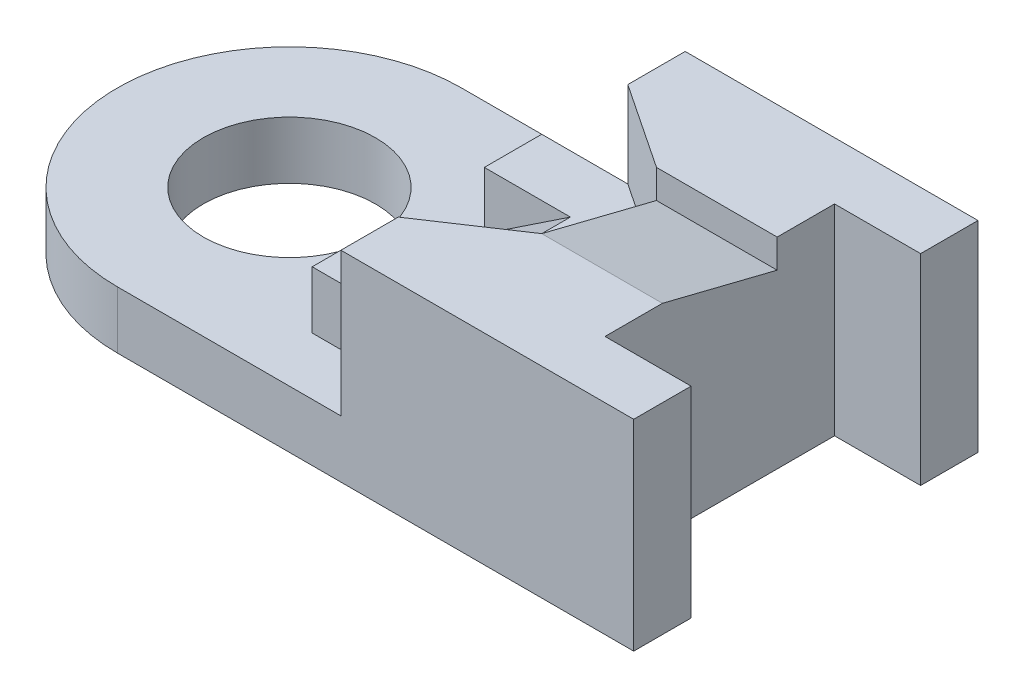
ISO-10303-21;
HEADER;
FILE_DESCRIPTION(('STEP AP214'),'2;1');
FILE_NAME('part.step','',(''),(''),'','','');
FILE_SCHEMA(('AUTOMOTIVE_DESIGN { 1 0 10303 214 1 1 1 1 }'));
ENDSEC;
DATA;
#1=APPLICATION_CONTEXT('core data for automotive mechanical design processes');
#2=APPLICATION_PROTOCOL_DEFINITION('international standard','automotive_design',2000,#1);
#3=PRODUCT_CONTEXT('',#1,'mechanical');
#4=PRODUCT('Part','Part','',(#3));
#5=PRODUCT_RELATED_PRODUCT_CATEGORY('part','',(#4));
#6=PRODUCT_DEFINITION_FORMATION('','',#4);
#7=PRODUCT_DEFINITION_CONTEXT('part definition',#1,'design');
#8=PRODUCT_DEFINITION('design','',#6,#7);
#9=PRODUCT_DEFINITION_SHAPE('','',#8);
#10=(LENGTH_UNIT() NAMED_UNIT(*) SI_UNIT(.MILLI.,.METRE.));
#11=(NAMED_UNIT(*) PLANE_ANGLE_UNIT() SI_UNIT($,.RADIAN.));
#12=(NAMED_UNIT(*) SI_UNIT($,.STERADIAN.) SOLID_ANGLE_UNIT());
#13=UNCERTAINTY_MEASURE_WITH_UNIT(LENGTH_MEASURE(1.E-05),#10,'distance_accuracy_value','');
#14=(GEOMETRIC_REPRESENTATION_CONTEXT(3) GLOBAL_UNCERTAINTY_ASSIGNED_CONTEXT((#13)) GLOBAL_UNIT_ASSIGNED_CONTEXT((#10,
#11,#12)) REPRESENTATION_CONTEXT('',''));
#15=CARTESIAN_POINT('',(0.,0.,0.));
#16=DIRECTION('',(0.,0.,1.));
#17=DIRECTION('',(1.,0.,0.));
#18=AXIS2_PLACEMENT_3D('',#15,#16,#17);
#19=CARTESIAN_POINT('',(0.,7.,0.));
#20=DIRECTION('',(0.,1.,0.));
#21=DIRECTION('',(0.,0.,1.));
#22=AXIS2_PLACEMENT_3D('',#19,#20,#21);
#23=PLANE('',#22);
#24=DIRECTION('',(-1.,0.,0.));
#25=VECTOR('',#24,1.);
#26=CARTESIAN_POINT('',(0.,7.,-2.));
#27=LINE('',#26,#25);
#28=CARTESIAN_POINT('',(6.,7.,-2.));
#29=VERTEX_POINT('',#28);
#30=CARTESIAN_POINT('',(1.79431217059984,7.,-2.));
#31=VERTEX_POINT('',#30);
#32=EDGE_CURVE('E11',#29,#31,#27,.T.);
#33=ORIENTED_EDGE('',*,*,#32,.F.);
#34=DIRECTION('',(0.,0.,-1.));
#35=VECTOR('',#34,1.);
#36=CARTESIAN_POINT('',(6.,7.,4.));
#37=LINE('',#36,#35);
#38=CARTESIAN_POINT('',(6.,7.,-4.));
#39=VERTEX_POINT('',#38);
#40=EDGE_CURVE('E208',#29,#39,#37,.T.);
#41=ORIENTED_EDGE('',*,*,#40,.T.);
#42=DIRECTION('',(1.,0.,0.));
#43=VECTOR('',#42,1.);
#44=CARTESIAN_POINT('',(6.,7.,-4.));
#45=LINE('',#44,#43);
#46=CARTESIAN_POINT('',(9.,7.,-4.));
#47=VERTEX_POINT('',#46);
#48=EDGE_CURVE('E207',#39,#47,#45,.T.);
#49=ORIENTED_EDGE('',*,*,#48,.T.);
#50=DIRECTION('',(0.,0.,-1.));
#51=VECTOR('',#50,1.);
#52=CARTESIAN_POINT('',(9.,7.,-4.));
#53=LINE('',#52,#51);
#54=CARTESIAN_POINT('',(9.,7.,-6.));
#55=VERTEX_POINT('',#54);
#56=EDGE_CURVE('E222',#47,#55,#53,.T.);
#57=ORIENTED_EDGE('',*,*,#56,.T.);
#58=DIRECTION('',(-1.,0.,0.));
#59=VECTOR('',#58,1.);
#60=CARTESIAN_POINT('',(9.,7.,-6.));
#61=LINE('',#60,#59);
#62=CARTESIAN_POINT('',(-1.20568782940016,7.,-6.));
#63=VERTEX_POINT('',#62);
#64=EDGE_CURVE('E383',#55,#63,#61,.T.);
#65=ORIENTED_EDGE('',*,*,#64,.T.);
#66=DIRECTION('',(0.,0.,1.));
#67=VECTOR('',#66,1.);
#68=CARTESIAN_POINT('',(-1.20568782940016,7.,-6.));
#69=LINE('',#68,#67);
#70=CARTESIAN_POINT('',(-1.20568782940016,7.,-4.));
#71=VERTEX_POINT('',#70);
#72=EDGE_CURVE('E381',#63,#71,#69,.T.);
#73=ORIENTED_EDGE('',*,*,#72,.T.);
#74=DIRECTION('',(0.832050294337844,0.,0.554700196225229));
#75=VECTOR('',#74,1.);
#76=CARTESIAN_POINT('',(-1.20568782940016,7.,-4.));
#77=LINE('',#76,#75);
#78=EDGE_CURVE('E378',#71,#31,#77,.T.);
#79=ORIENTED_EDGE('',*,*,#78,.T.);
#80=EDGE_LOOP('',(#33,#41,#49,#57,#65,#73,#79));
#81=FACE_BOUND('',#80,.T.);
#82=ADVANCED_FACE('F33',(#81),#23,.T.);
#83=CARTESIAN_POINT('',(-4.20568782940016,4.,-4.));
#84=DIRECTION('',(1.,0.,0.));
#85=DIRECTION('',(0.,0.,-1.));
#86=AXIS2_PLACEMENT_3D('',#83,#84,#85);
#87=PLANE('',#86);
#88=DIRECTION('',(0.,-1.,0.));
#89=VECTOR('',#88,1.);
#90=CARTESIAN_POINT('',(-4.20568782940015,2.,-2.));
#91=LINE('',#90,#89);
#92=CARTESIAN_POINT('',(-4.20568782940015,4.,-2.));
#93=VERTEX_POINT('',#92);
#94=CARTESIAN_POINT('',(-4.20568782940015,2.,-2.));
#95=VERTEX_POINT('',#94);
#96=EDGE_CURVE('E237',#93,#95,#91,.T.);
#97=ORIENTED_EDGE('',*,*,#96,.F.);
#98=DIRECTION('',(0.,0.,1.));
#99=VECTOR('',#98,1.);
#100=CARTESIAN_POINT('',(-4.20568782940016,4.,-4.));
#101=LINE('',#100,#99);
#102=CARTESIAN_POINT('',(-4.20568782940016,4.,-4.));
#103=VERTEX_POINT('',#102);
#104=EDGE_CURVE('E257',#103,#93,#101,.T.);
#105=ORIENTED_EDGE('',*,*,#104,.F.);
#106=DIRECTION('',(0.,-1.,0.));
#107=VECTOR('',#106,1.);
#108=CARTESIAN_POINT('',(-4.20568782940016,4.,-4.));
#109=LINE('',#108,#107);
#110=CARTESIAN_POINT('',(-4.20568782940016,2.,-4.));
#111=VERTEX_POINT('',#110);
#112=EDGE_CURVE('E285',#103,#111,#109,.T.);
#113=ORIENTED_EDGE('',*,*,#112,.T.);
#114=DIRECTION('',(0.,0.,1.));
#115=VECTOR('',#114,1.);
#116=CARTESIAN_POINT('',(-4.20568782940016,2.,-4.));
#117=LINE('',#116,#115);
#118=EDGE_CURVE('E269',#111,#95,#117,.T.);
#119=ORIENTED_EDGE('',*,*,#118,.T.);
#120=EDGE_LOOP('',(#97,#105,#113,#119));
#121=FACE_BOUND('',#120,.T.);
#122=ADVANCED_FACE('F441',(#121),#87,.F.);
#123=CARTESIAN_POINT('',(0.,4.,0.));
#124=DIRECTION('',(0.,1.,0.));
#125=DIRECTION('',(0.,0.,1.));
#126=AXIS2_PLACEMENT_3D('',#123,#124,#125);
#127=PLANE('',#126);
#128=DIRECTION('',(-0.832050294337844,0.,0.554700196225229));
#129=VECTOR('',#128,1.);
#130=CARTESIAN_POINT('',(1.79431217059984,4.,2.));
#131=LINE('',#130,#129);
#132=CARTESIAN_POINT('',(1.79431217059984,4.,2.));
#133=VERTEX_POINT('',#132);
#134=CARTESIAN_POINT('',(-1.20568782940016,4.,4.));
#135=VERTEX_POINT('',#134);
#136=EDGE_CURVE('E48',#133,#135,#131,.T.);
#137=ORIENTED_EDGE('',*,*,#136,.F.);
#138=DIRECTION('',(0.,0.,1.));
#139=VECTOR('',#138,1.);
#140=CARTESIAN_POINT('',(1.79431217059984,4.,-2.));
#141=LINE('',#140,#139);
#142=CARTESIAN_POINT('',(1.79431217059984,4.,-2.));
#143=VERTEX_POINT('',#142);
#144=EDGE_CURVE('E219',#143,#133,#141,.T.);
#145=ORIENTED_EDGE('',*,*,#144,.F.);
#146=DIRECTION('',(0.832050294337844,0.,0.554700196225229));
#147=VECTOR('',#146,1.);
#148=CARTESIAN_POINT('',(-1.20568782940016,4.,-4.));
#149=LINE('',#148,#147);
#150=CARTESIAN_POINT('',(-1.20568782940016,4.,-4.));
#151=VERTEX_POINT('',#150);
#152=EDGE_CURVE('E216',#151,#143,#149,.T.);
#153=ORIENTED_EDGE('',*,*,#152,.F.);
#154=DIRECTION('',(-1.,0.,0.));
#155=VECTOR('',#154,1.);
#156=CARTESIAN_POINT('',(-1.20568782940016,4.,-4.));
#157=LINE('',#156,#155);
#158=EDGE_CURVE('E253',#151,#103,#157,.T.);
#159=ORIENTED_EDGE('',*,*,#158,.T.);
#160=ORIENTED_EDGE('',*,*,#104,.T.);
#161=DIRECTION('',(-1.,0.,0.));
#162=VECTOR('',#161,1.);
#163=CARTESIAN_POINT('',(-4.20568782940015,4.,-2.));
#164=LINE('',#163,#162);
#165=CARTESIAN_POINT('',(-1.20568782940016,4.,-2.));
#166=VERTEX_POINT('',#165);
#167=EDGE_CURVE('E235',#166,#93,#164,.T.);
#168=ORIENTED_EDGE('',*,*,#167,.F.);
#169=DIRECTION('',(0.,0.,1.));
#170=VECTOR('',#169,1.);
#171=CARTESIAN_POINT('',(-1.20568782940016,4.,-2.));
#172=LINE('',#171,#170);
#173=CARTESIAN_POINT('',(-1.20568782940016,4.,2.));
#174=VERTEX_POINT('',#173);
#175=EDGE_CURVE('E248',#166,#174,#172,.T.);
#176=ORIENTED_EDGE('',*,*,#175,.T.);
#177=DIRECTION('',(-1.,0.,0.));
#178=VECTOR('',#177,1.);
#179=CARTESIAN_POINT('',(-4.20568782940015,4.,2.));
#180=LINE('',#179,#178);
#181=CARTESIAN_POINT('',(-4.20568782940015,4.,2.));
#182=VERTEX_POINT('',#181);
#183=EDGE_CURVE('E234',#174,#182,#180,.T.);
#184=ORIENTED_EDGE('',*,*,#183,.T.);
#185=CARTESIAN_POINT('',(-4.20568782940015,4.,4.));
#186=VERTEX_POINT('',#185);
#187=EDGE_CURVE('E255',#182,#186,#101,.T.);
#188=ORIENTED_EDGE('',*,*,#187,.T.);
#189=DIRECTION('',(1.,0.,0.));
#190=VECTOR('',#189,1.);
#191=CARTESIAN_POINT('',(-4.20568782940015,4.,4.));
#192=LINE('',#191,#190);
#193=EDGE_CURVE('E260',#186,#135,#192,.T.);
#194=ORIENTED_EDGE('',*,*,#193,.T.);
#195=EDGE_LOOP('',(#137,#145,#153,#159,#160,#168,#176,#184,#188,#194));
#196=FACE_BOUND('',#195,.T.);
#197=ADVANCED_FACE('F446',(#196),#127,.T.);
#198=CARTESIAN_POINT('',(-9.,2.,0.));
#199=DIRECTION('',(0.,1.,0.));
#200=DIRECTION('',(0.,0.,1.));
#201=AXIS2_PLACEMENT_3D('',#198,#199,#200);
#202=PLANE('',#201);
#203=DIRECTION('',(0.,0.,1.));
#204=VECTOR('',#203,1.);
#205=CARTESIAN_POINT('',(-1.20568782940016,2.,4.));
#206=LINE('',#205,#204);
#207=CARTESIAN_POINT('',(-1.20568782940016,2.,4.));
#208=VERTEX_POINT('',#207);
#209=CARTESIAN_POINT('',(-1.20568782940016,2.,6.));
#210=VERTEX_POINT('',#209);
#211=EDGE_CURVE('E256',#208,#210,#206,.T.);
#212=ORIENTED_EDGE('',*,*,#211,.F.);
#213=DIRECTION('',(1.,0.,0.));
#214=VECTOR('',#213,1.);
#215=CARTESIAN_POINT('',(-4.20568782940015,2.,4.));
#216=LINE('',#215,#214);
#217=CARTESIAN_POINT('',(-4.20568782940015,2.,4.));
#218=VERTEX_POINT('',#217);
#219=EDGE_CURVE('E272',#218,#208,#216,.T.);
#220=ORIENTED_EDGE('',*,*,#219,.F.);
#221=CARTESIAN_POINT('',(-4.20568782940015,2.,2.));
#222=VERTEX_POINT('',#221);
#223=EDGE_CURVE('E268',#222,#218,#117,.T.);
#224=ORIENTED_EDGE('',*,*,#223,.F.);
#225=DIRECTION('',(0.,0.,1.));
#226=VECTOR('',#225,1.);
#227=CARTESIAN_POINT('',(-4.20568782940015,2.,-2.));
#228=LINE('',#227,#226);
#229=EDGE_CURVE('E243',#95,#222,#228,.T.);
#230=ORIENTED_EDGE('',*,*,#229,.F.);
#231=ORIENTED_EDGE('',*,*,#118,.F.);
#232=DIRECTION('',(-1.,0.,0.));
#233=VECTOR('',#232,1.);
#234=CARTESIAN_POINT('',(-1.20568782940016,2.,-4.));
#235=LINE('',#234,#233);
#236=CARTESIAN_POINT('',(-1.20568782940016,2.,-4.));
#237=VERTEX_POINT('',#236);
#238=EDGE_CURVE('E265',#237,#111,#235,.T.);
#239=ORIENTED_EDGE('',*,*,#238,.F.);
#240=DIRECTION('',(0.,0.,1.));
#241=VECTOR('',#240,1.);
#242=CARTESIAN_POINT('',(-1.20568782940016,2.,-6.));
#243=LINE('',#242,#241);
#244=CARTESIAN_POINT('',(-1.20568782940016,2.,-6.));
#245=VERTEX_POINT('',#244);
#246=EDGE_CURVE('E251',#245,#237,#243,.T.);
#247=ORIENTED_EDGE('',*,*,#246,.F.);
#248=DIRECTION('',(-1.,0.,0.));
#249=VECTOR('',#248,1.);
#250=CARTESIAN_POINT('',(-9.,2.,-6.));
#251=LINE('',#250,#249);
#252=CARTESIAN_POINT('',(-9.,2.,-6.));
#253=VERTEX_POINT('',#252);
#254=EDGE_CURVE('E301',#245,#253,#251,.T.);
#255=ORIENTED_EDGE('',*,*,#254,.T.);
#256=CARTESIAN_POINT('',(-9.,2.,0.));
#257=DIRECTION('',(0.,1.,0.));
#258=DIRECTION('',(0.,0.,1.));
#259=AXIS2_PLACEMENT_3D('',#256,#257,#258);
#260=CIRCLE('',#259,6.);
#261=CARTESIAN_POINT('',(-9.,2.,6.));
#262=VERTEX_POINT('',#261);
#263=EDGE_CURVE('E303',#253,#262,#260,.T.);
#264=ORIENTED_EDGE('',*,*,#263,.T.);
#265=DIRECTION('',(1.,0.,0.));
#266=VECTOR('',#265,1.);
#267=CARTESIAN_POINT('',(-9.,2.,6.));
#268=LINE('',#267,#266);
#269=EDGE_CURVE('E306',#262,#210,#268,.T.);
#270=ORIENTED_EDGE('',*,*,#269,.T.);
#271=EDGE_LOOP('',(#212,#220,#224,#230,#231,#239,#247,#255,#264,#270));
#272=FACE_BOUND('',#271,.T.);
#273=CARTESIAN_POINT('',(-9.,2.,0.));
#274=DIRECTION('',(0.,1.,0.));
#275=DIRECTION('',(0.,0.,1.));
#276=AXIS2_PLACEMENT_3D('',#273,#274,#275);
#277=CIRCLE('',#276,3.);
#278=CARTESIAN_POINT('',(-9.,2.,3.));
#279=VERTEX_POINT('',#278);
#280=EDGE_CURVE('E295',#279,#279,#277,.T.);
#281=ORIENTED_EDGE('',*,*,#280,.F.);
#282=EDGE_LOOP('',(#281));
#283=FACE_BOUND('',#282,.T.);
#284=ADVANCED_FACE('F426',(#272,#283),#202,.T.);
#285=CARTESIAN_POINT('',(-9.,0.,0.));
#286=DIRECTION('',(0.,1.,0.));
#287=DIRECTION('',(0.,0.,1.));
#288=AXIS2_PLACEMENT_3D('',#285,#286,#287);
#289=PLANE('',#288);
#290=DIRECTION('',(-1.,0.,0.));
#291=VECTOR('',#290,1.);
#292=CARTESIAN_POINT('',(-9.,0.,-6.));
#293=LINE('',#292,#291);
#294=CARTESIAN_POINT('',(9.,0.,-6.));
#295=VERTEX_POINT('',#294);
#296=CARTESIAN_POINT('',(-9.,0.,-6.));
#297=VERTEX_POINT('',#296);
#298=EDGE_CURVE('E298',#295,#297,#293,.T.);
#299=ORIENTED_EDGE('',*,*,#298,.F.);
#300=DIRECTION('',(0.,0.,-1.));
#301=VECTOR('',#300,1.);
#302=CARTESIAN_POINT('',(9.,0.,-4.));
#303=LINE('',#302,#301);
#304=CARTESIAN_POINT('',(9.,0.,-4.));
#305=VERTEX_POINT('',#304);
#306=EDGE_CURVE('E304',#305,#295,#303,.T.);
#307=ORIENTED_EDGE('',*,*,#306,.F.);
#308=DIRECTION('',(1.,0.,0.));
#309=VECTOR('',#308,1.);
#310=CARTESIAN_POINT('',(9.,0.,-4.));
#311=LINE('',#310,#309);
#312=CARTESIAN_POINT('',(6.,0.,-4.));
#313=VERTEX_POINT('',#312);
#314=EDGE_CURVE('E321',#313,#305,#311,.T.);
#315=ORIENTED_EDGE('',*,*,#314,.F.);
#316=DIRECTION('',(0.,0.,-1.));
#317=VECTOR('',#316,1.);
#318=CARTESIAN_POINT('',(6.,0.,-4.));
#319=LINE('',#318,#317);
#320=CARTESIAN_POINT('',(6.,0.,4.));
#321=VERTEX_POINT('',#320);
#322=EDGE_CURVE('E319',#321,#313,#319,.T.);
#323=ORIENTED_EDGE('',*,*,#322,.F.);
#324=DIRECTION('',(-1.,0.,0.));
#325=VECTOR('',#324,1.);
#326=CARTESIAN_POINT('',(9.,0.,4.));
#327=LINE('',#326,#325);
#328=CARTESIAN_POINT('',(9.,0.,4.));
#329=VERTEX_POINT('',#328);
#330=EDGE_CURVE('E317',#329,#321,#327,.T.);
#331=ORIENTED_EDGE('',*,*,#330,.F.);
#332=DIRECTION('',(0.,0.,-1.));
#333=VECTOR('',#332,1.);
#334=CARTESIAN_POINT('',(9.,0.,6.));
#335=LINE('',#334,#333);
#336=CARTESIAN_POINT('',(9.,0.,6.));
#337=VERTEX_POINT('',#336);
#338=EDGE_CURVE('E315',#337,#329,#335,.T.);
#339=ORIENTED_EDGE('',*,*,#338,.F.);
#340=DIRECTION('',(1.,0.,0.));
#341=VECTOR('',#340,1.);
#342=CARTESIAN_POINT('',(-9.,0.,6.));
#343=LINE('',#342,#341);
#344=CARTESIAN_POINT('',(-9.,0.,6.));
#345=VERTEX_POINT('',#344);
#346=EDGE_CURVE('E313',#345,#337,#343,.T.);
#347=ORIENTED_EDGE('',*,*,#346,.F.);
#348=CARTESIAN_POINT('',(-9.,0.,0.));
#349=DIRECTION('',(0.,1.,0.));
#350=DIRECTION('',(0.,0.,1.));
#351=AXIS2_PLACEMENT_3D('',#348,#349,#350);
#352=CIRCLE('',#351,6.);
#353=EDGE_CURVE('E311',#297,#345,#352,.T.);
#354=ORIENTED_EDGE('',*,*,#353,.F.);
#355=EDGE_LOOP('',(#299,#307,#315,#323,#331,#339,#347,#354));
#356=FACE_BOUND('',#355,.T.);
#357=CARTESIAN_POINT('',(-9.,0.,0.));
#358=DIRECTION('',(0.,1.,0.));
#359=DIRECTION('',(0.,0.,1.));
#360=AXIS2_PLACEMENT_3D('',#357,#358,#359);
#361=CIRCLE('',#360,3.);
#362=CARTESIAN_POINT('',(-9.,0.,3.));
#363=VERTEX_POINT('',#362);
#364=EDGE_CURVE('E294',#363,#363,#361,.T.);
#365=ORIENTED_EDGE('',*,*,#364,.T.);
#366=EDGE_LOOP('',(#365));
#367=FACE_BOUND('',#366,.T.);
#368=ADVANCED_FACE('F355',(#356,#367),#289,.F.);
#369=CARTESIAN_POINT('',(-9.,2.,-6.));
#370=DIRECTION('',(0.,0.,1.));
#371=DIRECTION('',(1.,0.,0.));
#372=AXIS2_PLACEMENT_3D('',#369,#370,#371);
#373=PLANE('',#372);
#374=ORIENTED_EDGE('',*,*,#298,.T.);
#375=DIRECTION('',(0.,-1.,0.));
#376=VECTOR('',#375,1.);
#377=CARTESIAN_POINT('',(-9.,2.,-6.));
#378=LINE('',#377,#376);
#379=EDGE_CURVE('E193',#253,#297,#378,.T.);
#380=ORIENTED_EDGE('',*,*,#379,.F.);
#381=ORIENTED_EDGE('',*,*,#254,.F.);
#382=DIRECTION('',(0.,-1.,0.));
#383=VECTOR('',#382,1.);
#384=CARTESIAN_POINT('',(-1.20568782940016,4.,-6.));
#385=LINE('',#384,#383);
#386=EDGE_CURVE('E291',#63,#245,#385,.T.);
#387=ORIENTED_EDGE('',*,*,#386,.F.);
#388=ORIENTED_EDGE('',*,*,#64,.F.);
#389=DIRECTION('',(0.,-1.,0.));
#390=VECTOR('',#389,1.);
#391=CARTESIAN_POINT('',(9.,2.,-6.));
#392=LINE('',#391,#390);
#393=EDGE_CURVE('E308',#55,#295,#392,.T.);
#394=ORIENTED_EDGE('',*,*,#393,.T.);
#395=EDGE_LOOP('',(#374,#380,#381,#387,#388,#394));
#396=FACE_BOUND('',#395,.T.);
#397=ADVANCED_FACE('F35',(#396),#373,.F.);
#398=CARTESIAN_POINT('',(-9.,2.,0.));
#399=DIRECTION('',(0.,-1.,0.));
#400=DIRECTION('',(0.,0.,-1.));
#401=AXIS2_PLACEMENT_3D('',#398,#399,#400);
#402=CYLINDRICAL_SURFACE('',#401,6.);
#403=ORIENTED_EDGE('',*,*,#353,.T.);
#404=DIRECTION('',(0.,-1.,0.));
#405=VECTOR('',#404,1.);
#406=CARTESIAN_POINT('',(-9.,2.,6.));
#407=LINE('',#406,#405);
#408=EDGE_CURVE('E340',#262,#345,#407,.T.);
#409=ORIENTED_EDGE('',*,*,#408,.F.);
#410=ORIENTED_EDGE('',*,*,#263,.F.);
#411=ORIENTED_EDGE('',*,*,#379,.T.);
#412=EDGE_LOOP('',(#403,#409,#410,#411));
#413=FACE_BOUND('',#412,.T.);
#414=ADVANCED_FACE('F347',(#413),#402,.T.);
#415=CARTESIAN_POINT('',(-9.,2.,6.));
#416=DIRECTION('',(0.,0.,-1.));
#417=DIRECTION('',(-1.,0.,0.));
#418=AXIS2_PLACEMENT_3D('',#415,#416,#417);
#419=PLANE('',#418);
#420=ORIENTED_EDGE('',*,*,#346,.T.);
#421=DIRECTION('',(0.,-1.,0.));
#422=VECTOR('',#421,1.);
#423=CARTESIAN_POINT('',(9.,2.,6.));
#424=LINE('',#423,#422);
#425=CARTESIAN_POINT('',(9.,7.,6.));
#426=VERTEX_POINT('',#425);
#427=EDGE_CURVE('E337',#426,#337,#424,.T.);
#428=ORIENTED_EDGE('',*,*,#427,.F.);
#429=DIRECTION('',(1.,0.,0.));
#430=VECTOR('',#429,1.);
#431=CARTESIAN_POINT('',(-1.20568782940016,7.,6.));
#432=LINE('',#431,#430);
#433=CARTESIAN_POINT('',(-1.20568782940016,7.,6.));
#434=VERTEX_POINT('',#433);
#435=EDGE_CURVE('E370',#434,#426,#432,.T.);
#436=ORIENTED_EDGE('',*,*,#435,.F.);
#437=DIRECTION('',(0.,-1.,0.));
#438=VECTOR('',#437,1.);
#439=CARTESIAN_POINT('',(-1.20568782940016,4.,6.));
#440=LINE('',#439,#438);
#441=EDGE_CURVE('E262',#434,#210,#440,.T.);
#442=ORIENTED_EDGE('',*,*,#441,.T.);
#443=ORIENTED_EDGE('',*,*,#269,.F.);
#444=ORIENTED_EDGE('',*,*,#408,.T.);
#445=EDGE_LOOP('',(#420,#428,#436,#442,#443,#444));
#446=FACE_BOUND('',#445,.T.);
#447=ADVANCED_FACE('F362',(#446),#419,.F.);
#448=CARTESIAN_POINT('',(9.,2.,6.));
#449=DIRECTION('',(-1.,0.,0.));
#450=DIRECTION('',(0.,0.,1.));
#451=AXIS2_PLACEMENT_3D('',#448,#449,#450);
#452=PLANE('',#451);
#453=ORIENTED_EDGE('',*,*,#338,.T.);
#454=DIRECTION('',(0.,-1.,0.));
#455=VECTOR('',#454,1.);
#456=CARTESIAN_POINT('',(9.,2.,4.));
#457=LINE('',#456,#455);
#458=CARTESIAN_POINT('',(9.,7.,4.));
#459=VERTEX_POINT('',#458);
#460=EDGE_CURVE('E334',#459,#329,#457,.T.);
#461=ORIENTED_EDGE('',*,*,#460,.F.);
#462=DIRECTION('',(0.,0.,-1.));
#463=VECTOR('',#462,1.);
#464=CARTESIAN_POINT('',(9.,7.,6.));
#465=LINE('',#464,#463);
#466=EDGE_CURVE('E369',#426,#459,#465,.T.);
#467=ORIENTED_EDGE('',*,*,#466,.F.);
#468=ORIENTED_EDGE('',*,*,#427,.T.);
#469=EDGE_LOOP('',(#453,#461,#467,#468));
#470=FACE_BOUND('',#469,.T.);
#471=ADVANCED_FACE('F368',(#470),#452,.F.);
#472=CARTESIAN_POINT('',(9.,2.,4.));
#473=DIRECTION('',(0.,0.,1.));
#474=DIRECTION('',(1.,0.,0.));
#475=AXIS2_PLACEMENT_3D('',#472,#473,#474);
#476=PLANE('',#475);
#477=ORIENTED_EDGE('',*,*,#330,.T.);
#478=DIRECTION('',(0.,-1.,0.));
#479=VECTOR('',#478,1.);
#480=CARTESIAN_POINT('',(6.,2.,4.));
#481=LINE('',#480,#479);
#482=CARTESIAN_POINT('',(6.,7.,4.));
#483=VERTEX_POINT('',#482);
#484=EDGE_CURVE('E332',#483,#321,#481,.T.);
#485=ORIENTED_EDGE('',*,*,#484,.F.);
#486=DIRECTION('',(-1.,0.,0.));
#487=VECTOR('',#486,1.);
#488=CARTESIAN_POINT('',(9.,7.,4.));
#489=LINE('',#488,#487);
#490=EDGE_CURVE('E206',#459,#483,#489,.T.);
#491=ORIENTED_EDGE('',*,*,#490,.F.);
#492=ORIENTED_EDGE('',*,*,#460,.T.);
#493=EDGE_LOOP('',(#477,#485,#491,#492));
#494=FACE_BOUND('',#493,.T.);
#495=ADVANCED_FACE('F494',(#494),#476,.F.);
#496=CARTESIAN_POINT('',(6.,2.,-4.));
#497=DIRECTION('',(-1.,0.,0.));
#498=DIRECTION('',(0.,0.,1.));
#499=AXIS2_PLACEMENT_3D('',#496,#497,#498);
#500=PLANE('',#499);
#501=ORIENTED_EDGE('',*,*,#40,.F.);
#502=DIRECTION('',(0.,1.,0.));
#503=VECTOR('',#502,1.);
#504=CARTESIAN_POINT('',(6.,7.,-2.));
#505=LINE('',#504,#503);
#506=CARTESIAN_POINT('',(6.,6.,-2.));
#507=VERTEX_POINT('',#506);
#508=EDGE_CURVE('E200',#507,#29,#505,.T.);
#509=ORIENTED_EDGE('',*,*,#508,.F.);
#510=DIRECTION('',(0.,-0.242535625036333,-0.970142500145332));
#511=VECTOR('',#510,1.);
#512=CARTESIAN_POINT('',(6.,6.,-2.));
#513=LINE('',#512,#511);
#514=CARTESIAN_POINT('',(6.,7.,2.));
#515=VERTEX_POINT('',#514);
#516=EDGE_CURVE('E186',#515,#507,#513,.T.);
#517=ORIENTED_EDGE('',*,*,#516,.F.);
#518=EDGE_CURVE('E199',#483,#515,#37,.T.);
#519=ORIENTED_EDGE('',*,*,#518,.F.);
#520=ORIENTED_EDGE('',*,*,#484,.T.);
#521=ORIENTED_EDGE('',*,*,#322,.T.);
#522=DIRECTION('',(0.,-1.,0.));
#523=VECTOR('',#522,1.);
#524=CARTESIAN_POINT('',(6.,2.,-4.));
#525=LINE('',#524,#523);
#526=EDGE_CURVE('E329',#39,#313,#525,.T.);
#527=ORIENTED_EDGE('',*,*,#526,.F.);
#528=EDGE_LOOP('',(#501,#509,#517,#519,#520,#521,#527));
#529=FACE_BOUND('',#528,.T.);
#530=ADVANCED_FACE('F197',(#529),#500,.F.);
#531=CARTESIAN_POINT('',(9.,2.,-4.));
#532=DIRECTION('',(0.,0.,-1.));
#533=DIRECTION('',(-1.,0.,0.));
#534=AXIS2_PLACEMENT_3D('',#531,#532,#533);
#535=PLANE('',#534);
#536=ORIENTED_EDGE('',*,*,#314,.T.);
#537=DIRECTION('',(0.,-1.,0.));
#538=VECTOR('',#537,1.);
#539=CARTESIAN_POINT('',(9.,2.,-4.));
#540=LINE('',#539,#538);
#541=EDGE_CURVE('E326',#47,#305,#540,.T.);
#542=ORIENTED_EDGE('',*,*,#541,.F.);
#543=ORIENTED_EDGE('',*,*,#48,.F.);
#544=ORIENTED_EDGE('',*,*,#526,.T.);
#545=EDGE_LOOP('',(#536,#542,#543,#544));
#546=FACE_BOUND('',#545,.T.);
#547=ADVANCED_FACE('F401',(#546),#535,.F.);
#548=CARTESIAN_POINT('',(9.,2.,-4.));
#549=DIRECTION('',(-1.,0.,0.));
#550=DIRECTION('',(0.,0.,1.));
#551=AXIS2_PLACEMENT_3D('',#548,#549,#550);
#552=PLANE('',#551);
#553=ORIENTED_EDGE('',*,*,#306,.T.);
#554=ORIENTED_EDGE('',*,*,#393,.F.);
#555=ORIENTED_EDGE('',*,*,#56,.F.);
#556=ORIENTED_EDGE('',*,*,#541,.T.);
#557=EDGE_LOOP('',(#553,#554,#555,#556));
#558=FACE_BOUND('',#557,.T.);
#559=ADVANCED_FACE('F404',(#558),#552,.F.);
#560=CARTESIAN_POINT('',(-9.,2.,0.));
#561=DIRECTION('',(0.,-1.,0.));
#562=DIRECTION('',(0.,0.,-1.));
#563=AXIS2_PLACEMENT_3D('',#560,#561,#562);
#564=CYLINDRICAL_SURFACE('',#563,3.);
#565=ORIENTED_EDGE('',*,*,#280,.T.);
#566=EDGE_LOOP('',(#565));
#567=FACE_BOUND('',#566,.T.);
#568=ORIENTED_EDGE('',*,*,#364,.F.);
#569=EDGE_LOOP('',(#568));
#570=FACE_BOUND('',#569,.T.);
#571=ADVANCED_FACE('F543',(#567,#570),#564,.F.);
#572=CARTESIAN_POINT('',(-1.20568782940016,4.,-6.));
#573=DIRECTION('',(1.,0.,0.));
#574=DIRECTION('',(0.,0.,-1.));
#575=AXIS2_PLACEMENT_3D('',#572,#573,#574);
#576=PLANE('',#575);
#577=ORIENTED_EDGE('',*,*,#246,.T.);
#578=DIRECTION('',(0.,-1.,0.));
#579=VECTOR('',#578,1.);
#580=CARTESIAN_POINT('',(-1.20568782940016,4.,-4.));
#581=LINE('',#580,#579);
#582=EDGE_CURVE('E288',#151,#237,#581,.T.);
#583=ORIENTED_EDGE('',*,*,#582,.F.);
#584=DIRECTION('',(0.,-1.,0.));
#585=VECTOR('',#584,1.);
#586=CARTESIAN_POINT('',(-1.20568782940016,7.,-4.));
#587=LINE('',#586,#585);
#588=EDGE_CURVE('E231',#71,#151,#587,.T.);
#589=ORIENTED_EDGE('',*,*,#588,.F.);
#590=ORIENTED_EDGE('',*,*,#72,.F.);
#591=ORIENTED_EDGE('',*,*,#386,.T.);
#592=EDGE_LOOP('',(#577,#583,#589,#590,#591));
#593=FACE_BOUND('',#592,.T.);
#594=ADVANCED_FACE('F408',(#593),#576,.F.);
#595=CARTESIAN_POINT('',(-1.20568782940016,4.,-4.));
#596=DIRECTION('',(0.,0.,1.));
#597=DIRECTION('',(1.,0.,0.));
#598=AXIS2_PLACEMENT_3D('',#595,#596,#597);
#599=PLANE('',#598);
#600=ORIENTED_EDGE('',*,*,#238,.T.);
#601=ORIENTED_EDGE('',*,*,#112,.F.);
#602=ORIENTED_EDGE('',*,*,#158,.F.);
#603=ORIENTED_EDGE('',*,*,#582,.T.);
#604=EDGE_LOOP('',(#600,#601,#602,#603));
#605=FACE_BOUND('',#604,.T.);
#606=ADVANCED_FACE('F445',(#605),#599,.F.);
#607=ORIENTED_EDGE('',*,*,#187,.F.);
#608=DIRECTION('',(0.,-1.,0.));
#609=VECTOR('',#608,1.);
#610=CARTESIAN_POINT('',(-4.20568782940015,2.,2.));
#611=LINE('',#610,#609);
#612=EDGE_CURVE('E56',#182,#222,#611,.T.);
#613=ORIENTED_EDGE('',*,*,#612,.T.);
#614=ORIENTED_EDGE('',*,*,#223,.T.);
#615=DIRECTION('',(0.,-1.,0.));
#616=VECTOR('',#615,1.);
#617=CARTESIAN_POINT('',(-4.20568782940015,4.,4.));
#618=LINE('',#617,#616);
#619=EDGE_CURVE('E282',#186,#218,#618,.T.);
#620=ORIENTED_EDGE('',*,*,#619,.F.);
#621=EDGE_LOOP('',(#607,#613,#614,#620));
#622=FACE_BOUND('',#621,.T.);
#623=ADVANCED_FACE('F435',(#622),#87,.F.);
#624=CARTESIAN_POINT('',(-4.20568782940015,4.,4.));
#625=DIRECTION('',(0.,0.,-1.));
#626=DIRECTION('',(-1.,0.,0.));
#627=AXIS2_PLACEMENT_3D('',#624,#625,#626);
#628=PLANE('',#627);
#629=ORIENTED_EDGE('',*,*,#219,.T.);
#630=DIRECTION('',(0.,-1.,0.));
#631=VECTOR('',#630,1.);
#632=CARTESIAN_POINT('',(-1.20568782940016,4.,4.));
#633=LINE('',#632,#631);
#634=EDGE_CURVE('E279',#135,#208,#633,.T.);
#635=ORIENTED_EDGE('',*,*,#634,.F.);
#636=ORIENTED_EDGE('',*,*,#193,.F.);
#637=ORIENTED_EDGE('',*,*,#619,.T.);
#638=EDGE_LOOP('',(#629,#635,#636,#637));
#639=FACE_BOUND('',#638,.T.);
#640=ADVANCED_FACE('F430',(#639),#628,.F.);
#641=CARTESIAN_POINT('',(-1.20568782940016,4.,4.));
#642=DIRECTION('',(1.,0.,0.));
#643=DIRECTION('',(0.,0.,-1.));
#644=AXIS2_PLACEMENT_3D('',#641,#642,#643);
#645=PLANE('',#644);
#646=ORIENTED_EDGE('',*,*,#211,.T.);
#647=ORIENTED_EDGE('',*,*,#441,.F.);
#648=DIRECTION('',(0.,0.,1.));
#649=VECTOR('',#648,1.);
#650=CARTESIAN_POINT('',(-1.20568782940016,7.,4.));
#651=LINE('',#650,#649);
#652=CARTESIAN_POINT('',(-1.20568782940016,7.,4.));
#653=VERTEX_POINT('',#652);
#654=EDGE_CURVE('E371',#653,#434,#651,.T.);
#655=ORIENTED_EDGE('',*,*,#654,.F.);
#656=DIRECTION('',(0.,-1.,0.));
#657=VECTOR('',#656,1.);
#658=CARTESIAN_POINT('',(-1.20568782940016,7.,4.));
#659=LINE('',#658,#657);
#660=EDGE_CURVE('E211',#653,#135,#659,.T.);
#661=ORIENTED_EDGE('',*,*,#660,.T.);
#662=ORIENTED_EDGE('',*,*,#634,.T.);
#663=EDGE_LOOP('',(#646,#647,#655,#661,#662));
#664=FACE_BOUND('',#663,.T.);
#665=ADVANCED_FACE('F422',(#664),#645,.F.);
#666=CARTESIAN_POINT('',(-1.20568782940016,4.,-2.));
#667=DIRECTION('',(0.554700196225229,-0.832050294337843,0.));
#668=DIRECTION('',(0.832050294337843,0.554700196225229,0.));
#669=AXIS2_PLACEMENT_3D('',#666,#667,#668);
#670=PLANE('',#669);
#671=DIRECTION('',(0.832050294337843,0.554700196225229,0.));
#672=VECTOR('',#671,1.);
#673=CARTESIAN_POINT('',(-1.20568782940016,4.,2.));
#674=LINE('',#673,#672);
#675=EDGE_CURVE('E238',#222,#174,#674,.T.);
#676=ORIENTED_EDGE('',*,*,#675,.T.);
#677=ORIENTED_EDGE('',*,*,#175,.F.);
#678=DIRECTION('',(0.832050294337843,0.554700196225229,0.));
#679=VECTOR('',#678,1.);
#680=CARTESIAN_POINT('',(-1.20568782940016,4.,-2.));
#681=LINE('',#680,#679);
#682=EDGE_CURVE('E240',#95,#166,#681,.T.);
#683=ORIENTED_EDGE('',*,*,#682,.F.);
#684=ORIENTED_EDGE('',*,*,#229,.T.);
#685=EDGE_LOOP('',(#676,#677,#683,#684));
#686=FACE_BOUND('',#685,.T.);
#687=ADVANCED_FACE('F450',(#686),#670,.F.);
#688=CARTESIAN_POINT('',(0.,0.,-2.));
#689=DIRECTION('',(0.,0.,1.));
#690=DIRECTION('',(1.,0.,0.));
#691=AXIS2_PLACEMENT_3D('',#688,#689,#690);
#692=PLANE('',#691);
#693=ORIENTED_EDGE('',*,*,#167,.T.);
#694=ORIENTED_EDGE('',*,*,#96,.T.);
#695=ORIENTED_EDGE('',*,*,#682,.T.);
#696=EDGE_LOOP('',(#693,#694,#695));
#697=FACE_BOUND('',#696,.T.);
#698=ADVANCED_FACE('F449',(#697),#692,.T.);
#699=CARTESIAN_POINT('',(0.,0.,2.));
#700=DIRECTION('',(0.,0.,1.));
#701=DIRECTION('',(1.,0.,0.));
#702=AXIS2_PLACEMENT_3D('',#699,#700,#701);
#703=PLANE('',#702);
#704=ORIENTED_EDGE('',*,*,#183,.F.);
#705=ORIENTED_EDGE('',*,*,#675,.F.);
#706=ORIENTED_EDGE('',*,*,#612,.F.);
#707=EDGE_LOOP('',(#704,#705,#706));
#708=FACE_BOUND('',#707,.T.);
#709=ADVANCED_FACE('F451',(#708),#703,.F.);
#710=CARTESIAN_POINT('',(-1.20568782940016,7.,-4.));
#711=DIRECTION('',(0.554700196225229,0.,-0.832050294337844));
#712=DIRECTION('',(-0.832050294337844,0.,-0.554700196225229));
#713=AXIS2_PLACEMENT_3D('',#710,#711,#712);
#714=PLANE('',#713);
#715=ORIENTED_EDGE('',*,*,#152,.T.);
#716=DIRECTION('',(0.,-1.,0.));
#717=VECTOR('',#716,1.);
#718=CARTESIAN_POINT('',(1.79431217059984,7.,-2.));
#719=LINE('',#718,#717);
#720=CARTESIAN_POINT('',(1.79431217059984,6.,-2.));
#721=VERTEX_POINT('',#720);
#722=EDGE_CURVE('E228',#721,#143,#719,.T.);
#723=ORIENTED_EDGE('',*,*,#722,.F.);
#724=EDGE_CURVE('E229',#31,#721,#719,.T.);
#725=ORIENTED_EDGE('',*,*,#724,.F.);
#726=ORIENTED_EDGE('',*,*,#78,.F.);
#727=ORIENTED_EDGE('',*,*,#588,.T.);
#728=EDGE_LOOP('',(#715,#723,#725,#726,#727));
#729=FACE_BOUND('',#728,.T.);
#730=ADVANCED_FACE('F412',(#729),#714,.F.);
#731=CARTESIAN_POINT('',(1.79431217059984,7.,-2.));
#732=DIRECTION('',(1.,0.,0.));
#733=DIRECTION('',(0.,0.,-1.));
#734=AXIS2_PLACEMENT_3D('',#731,#732,#733);
#735=PLANE('',#734);
#736=DIRECTION('',(0.,-1.,0.));
#737=VECTOR('',#736,1.);
#738=CARTESIAN_POINT('',(1.79431217059984,7.,2.));
#739=LINE('',#738,#737);
#740=CARTESIAN_POINT('',(1.79431217059984,7.,2.));
#741=VERTEX_POINT('',#740);
#742=EDGE_CURVE('E225',#741,#133,#739,.T.);
#743=ORIENTED_EDGE('',*,*,#742,.F.);
#744=DIRECTION('',(0.,-0.242535625036333,-0.970142500145332));
#745=VECTOR('',#744,1.);
#746=CARTESIAN_POINT('',(1.79431217059984,6.05882352941176,-1.76470588235294));
#747=LINE('',#746,#745);
#748=EDGE_CURVE('E189',#741,#721,#747,.T.);
#749=ORIENTED_EDGE('',*,*,#748,.T.);
#750=ORIENTED_EDGE('',*,*,#722,.T.);
#751=ORIENTED_EDGE('',*,*,#144,.T.);
#752=EDGE_LOOP('',(#743,#749,#750,#751));
#753=FACE_BOUND('',#752,.T.);
#754=ADVANCED_FACE('F415',(#753),#735,.F.);
#755=CARTESIAN_POINT('',(1.79431217059984,7.,2.));
#756=DIRECTION('',(0.554700196225229,0.,0.832050294337844));
#757=DIRECTION('',(0.832050294337844,0.,-0.554700196225229));
#758=AXIS2_PLACEMENT_3D('',#755,#756,#757);
#759=PLANE('',#758);
#760=ORIENTED_EDGE('',*,*,#136,.T.);
#761=ORIENTED_EDGE('',*,*,#660,.F.);
#762=DIRECTION('',(-0.832050294337844,0.,0.554700196225229));
#763=VECTOR('',#762,1.);
#764=CARTESIAN_POINT('',(1.79431217059984,7.,2.));
#765=LINE('',#764,#763);
#766=EDGE_CURVE('E376',#741,#653,#765,.T.);
#767=ORIENTED_EDGE('',*,*,#766,.F.);
#768=ORIENTED_EDGE('',*,*,#742,.T.);
#769=EDGE_LOOP('',(#760,#761,#767,#768));
#770=FACE_BOUND('',#769,.T.);
#771=ADVANCED_FACE('F419',(#770),#759,.F.);
#772=DIRECTION('',(1.,0.,0.));
#773=VECTOR('',#772,1.);
#774=CARTESIAN_POINT('',(0.,7.,2.));
#775=LINE('',#774,#773);
#776=EDGE_CURVE('E41',#741,#515,#775,.T.);
#777=ORIENTED_EDGE('',*,*,#776,.F.);
#778=ORIENTED_EDGE('',*,*,#766,.T.);
#779=ORIENTED_EDGE('',*,*,#654,.T.);
#780=ORIENTED_EDGE('',*,*,#435,.T.);
#781=ORIENTED_EDGE('',*,*,#466,.T.);
#782=ORIENTED_EDGE('',*,*,#490,.T.);
#783=ORIENTED_EDGE('',*,*,#518,.T.);
#784=EDGE_LOOP('',(#777,#778,#779,#780,#781,#782,#783));
#785=FACE_BOUND('',#784,.T.);
#786=ADVANCED_FACE('F203',(#785),#23,.T.);
#787=CARTESIAN_POINT('',(-7.,7.,-2.));
#788=DIRECTION('',(0.,0.,-1.));
#789=DIRECTION('',(-1.,0.,0.));
#790=AXIS2_PLACEMENT_3D('',#787,#788,#789);
#791=PLANE('',#790);
#792=DIRECTION('',(1.,0.,0.));
#793=VECTOR('',#792,1.);
#794=CARTESIAN_POINT('',(-7.,6.,-2.));
#795=LINE('',#794,#793);
#796=EDGE_CURVE('E389',#721,#507,#795,.T.);
#797=ORIENTED_EDGE('',*,*,#796,.T.);
#798=ORIENTED_EDGE('',*,*,#508,.T.);
#799=ORIENTED_EDGE('',*,*,#32,.T.);
#800=ORIENTED_EDGE('',*,*,#724,.T.);
#801=EDGE_LOOP('',(#797,#798,#799,#800));
#802=FACE_BOUND('',#801,.T.);
#803=ADVANCED_FACE('F393',(#802),#791,.F.);
#804=CARTESIAN_POINT('',(-7.,6.,-2.));
#805=DIRECTION('',(0.,-0.970142500145332,0.242535625036333));
#806=DIRECTION('',(0.,-0.242535625036333,-0.970142500145332));
#807=AXIS2_PLACEMENT_3D('',#804,#805,#806);
#808=PLANE('',#807);
#809=ORIENTED_EDGE('',*,*,#776,.T.);
#810=ORIENTED_EDGE('',*,*,#516,.T.);
#811=ORIENTED_EDGE('',*,*,#796,.F.);
#812=ORIENTED_EDGE('',*,*,#748,.F.);
#813=EDGE_LOOP('',(#809,#810,#811,#812));
#814=FACE_BOUND('',#813,.T.);
#815=ADVANCED_FACE('F184',(#814),#808,.F.);
#816=CLOSED_SHELL('',(#82,#122,#197,#284,#368,#397,#414,#447,#471,#495,#530,#547,#559,#571,#594,
#606,#623,#640,#665,#687,#698,#709,#730,#754,#771,#786,#803,#815));
#817=MANIFOLD_SOLID_BREP('B2',#816);
#818=ADVANCED_BREP_SHAPE_REPRESENTATION('',(#18,#817),#14);
#819=SHAPE_DEFINITION_REPRESENTATION(#9,#818);
ENDSEC;
END-ISO-10303-21;
